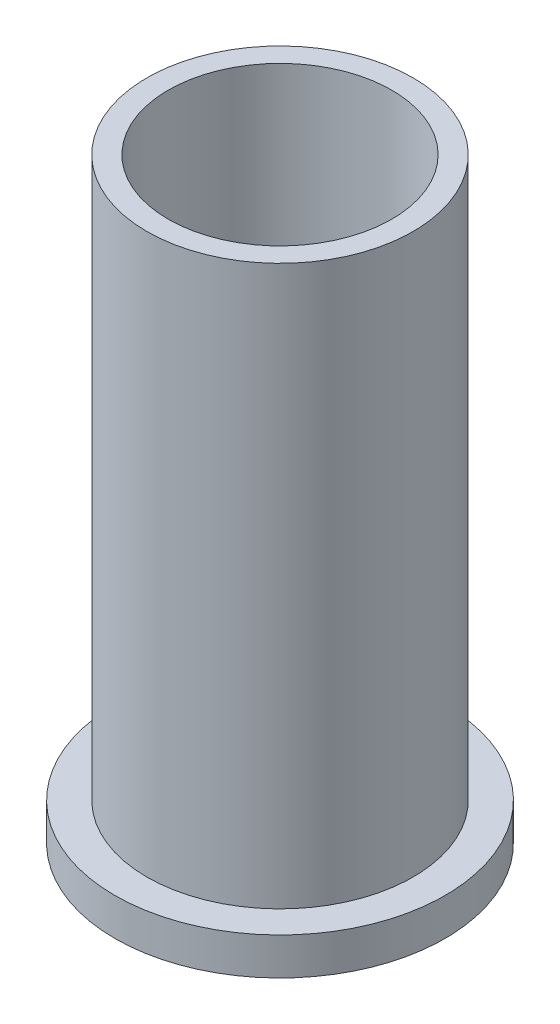
ISO-10303-21;
HEADER;
FILE_DESCRIPTION(('STEP AP214'),'2;1');
FILE_NAME('part.step','',(''),(''),'','','');
FILE_SCHEMA(('AUTOMOTIVE_DESIGN { 1 0 10303 214 1 1 1 1 }'));
ENDSEC;
DATA;
#1=APPLICATION_CONTEXT('core data for automotive mechanical design processes');
#2=APPLICATION_PROTOCOL_DEFINITION('international standard','automotive_design',2000,#1);
#3=PRODUCT_CONTEXT('',#1,'mechanical');
#4=PRODUCT('Part','Part','',(#3));
#5=PRODUCT_RELATED_PRODUCT_CATEGORY('part','',(#4));
#6=PRODUCT_DEFINITION_FORMATION('','',#4);
#7=PRODUCT_DEFINITION_CONTEXT('part definition',#1,'design');
#8=PRODUCT_DEFINITION('design','',#6,#7);
#9=PRODUCT_DEFINITION_SHAPE('','',#8);
#10=(LENGTH_UNIT() NAMED_UNIT(*) SI_UNIT(.MILLI.,.METRE.));
#11=(NAMED_UNIT(*) PLANE_ANGLE_UNIT() SI_UNIT($,.RADIAN.));
#12=(NAMED_UNIT(*) SI_UNIT($,.STERADIAN.) SOLID_ANGLE_UNIT());
#13=UNCERTAINTY_MEASURE_WITH_UNIT(LENGTH_MEASURE(1.E-05),#10,'distance_accuracy_value','');
#14=(GEOMETRIC_REPRESENTATION_CONTEXT(3) GLOBAL_UNCERTAINTY_ASSIGNED_CONTEXT((#13)) GLOBAL_UNIT_ASSIGNED_CONTEXT((#10,
#11,#12)) REPRESENTATION_CONTEXT('',''));
#15=CARTESIAN_POINT('',(0.,0.,0.));
#16=DIRECTION('',(0.,0.,1.));
#17=DIRECTION('',(1.,0.,0.));
#18=AXIS2_PLACEMENT_3D('',#15,#16,#17);
#19=CARTESIAN_POINT('',(0.,0.,0.));
#20=DIRECTION('',(0.,1.,0.));
#21=DIRECTION('',(0.,0.,1.));
#22=AXIS2_PLACEMENT_3D('',#19,#20,#21);
#23=CYLINDRICAL_SURFACE('',#22,21.);
#24=CARTESIAN_POINT('',(0.,-112.,0.));
#25=DIRECTION('',(0.,1.,0.));
#26=DIRECTION('',(0.,0.,1.));
#27=AXIS2_PLACEMENT_3D('',#24,#25,#26);
#28=CIRCLE('',#27,21.);
#29=CARTESIAN_POINT('',(0.,-112.,21.));
#30=VERTEX_POINT('',#29);
#31=EDGE_CURVE('E10',#30,#30,#28,.T.);
#32=ORIENTED_EDGE('',*,*,#31,.F.);
#33=EDGE_LOOP('',(#32));
#34=FACE_BOUND('',#33,.T.);
#35=CARTESIAN_POINT('',(0.,0.,0.));
#36=DIRECTION('',(0.,1.,0.));
#37=DIRECTION('',(0.,0.,1.));
#38=AXIS2_PLACEMENT_3D('',#35,#36,#37);
#39=CIRCLE('',#38,21.);
#40=CARTESIAN_POINT('',(0.,0.,21.));
#41=VERTEX_POINT('',#40);
#42=EDGE_CURVE('E53',#41,#41,#39,.T.);
#43=ORIENTED_EDGE('',*,*,#42,.T.);
#44=EDGE_LOOP('',(#43));
#45=FACE_BOUND('',#44,.T.);
#46=ADVANCED_FACE('F31',(#34,#45),#23,.F.);
#47=CARTESIAN_POINT('',(21.,-112.,0.));
#48=DIRECTION('',(0.,1.,0.));
#49=DIRECTION('',(0.,0.,1.));
#50=AXIS2_PLACEMENT_3D('',#47,#48,#49);
#51=PLANE('',#50);
#52=CARTESIAN_POINT('',(0.,-112.,0.));
#53=DIRECTION('',(0.,1.,0.));
#54=DIRECTION('',(0.,0.,1.));
#55=AXIS2_PLACEMENT_3D('',#52,#53,#54);
#56=CIRCLE('',#55,31.);
#57=CARTESIAN_POINT('',(0.,-112.,31.));
#58=VERTEX_POINT('',#57);
#59=EDGE_CURVE('E37',#58,#58,#56,.T.);
#60=ORIENTED_EDGE('',*,*,#59,.F.);
#61=EDGE_LOOP('',(#60));
#62=FACE_BOUND('',#61,.T.);
#63=ORIENTED_EDGE('',*,*,#31,.T.);
#64=EDGE_LOOP('',(#63));
#65=FACE_BOUND('',#64,.T.);
#66=ADVANCED_FACE('F78',(#62,#65),#51,.F.);
#67=CARTESIAN_POINT('',(0.,0.,0.));
#68=DIRECTION('',(0.,1.,0.));
#69=DIRECTION('',(0.,0.,1.));
#70=AXIS2_PLACEMENT_3D('',#67,#68,#69);
#71=CYLINDRICAL_SURFACE('',#70,31.);
#72=CARTESIAN_POINT('',(0.,-105.,0.));
#73=DIRECTION('',(0.,1.,0.));
#74=DIRECTION('',(0.,0.,1.));
#75=AXIS2_PLACEMENT_3D('',#72,#73,#74);
#76=CIRCLE('',#75,31.);
#77=CARTESIAN_POINT('',(0.,-105.,31.));
#78=VERTEX_POINT('',#77);
#79=EDGE_CURVE('E41',#78,#78,#76,.T.);
#80=ORIENTED_EDGE('',*,*,#79,.F.);
#81=EDGE_LOOP('',(#80));
#82=FACE_BOUND('',#81,.T.);
#83=ORIENTED_EDGE('',*,*,#59,.T.);
#84=EDGE_LOOP('',(#83));
#85=FACE_BOUND('',#84,.T.);
#86=ADVANCED_FACE('F73',(#82,#85),#71,.T.);
#87=CARTESIAN_POINT('',(25.,-105.,0.));
#88=DIRECTION('',(0.,-1.,0.));
#89=DIRECTION('',(0.,0.,-1.));
#90=AXIS2_PLACEMENT_3D('',#87,#88,#89);
#91=PLANE('',#90);
#92=CARTESIAN_POINT('',(0.,-105.,0.));
#93=DIRECTION('',(0.,1.,0.));
#94=DIRECTION('',(0.,0.,1.));
#95=AXIS2_PLACEMENT_3D('',#92,#93,#94);
#96=CIRCLE('',#95,25.);
#97=CARTESIAN_POINT('',(0.,-105.,25.));
#98=VERTEX_POINT('',#97);
#99=EDGE_CURVE('E45',#98,#98,#96,.T.);
#100=ORIENTED_EDGE('',*,*,#99,.F.);
#101=EDGE_LOOP('',(#100));
#102=FACE_BOUND('',#101,.T.);
#103=ORIENTED_EDGE('',*,*,#79,.T.);
#104=EDGE_LOOP('',(#103));
#105=FACE_BOUND('',#104,.T.);
#106=ADVANCED_FACE('F67',(#102,#105),#91,.F.);
#107=CARTESIAN_POINT('',(0.,0.,0.));
#108=DIRECTION('',(0.,1.,0.));
#109=DIRECTION('',(0.,0.,1.));
#110=AXIS2_PLACEMENT_3D('',#107,#108,#109);
#111=CYLINDRICAL_SURFACE('',#110,25.);
#112=CARTESIAN_POINT('',(0.,0.,0.));
#113=DIRECTION('',(0.,1.,0.));
#114=DIRECTION('',(0.,0.,1.));
#115=AXIS2_PLACEMENT_3D('',#112,#113,#114);
#116=CIRCLE('',#115,25.);
#117=CARTESIAN_POINT('',(0.,0.,25.));
#118=VERTEX_POINT('',#117);
#119=EDGE_CURVE('E50',#118,#118,#116,.T.);
#120=ORIENTED_EDGE('',*,*,#119,.F.);
#121=EDGE_LOOP('',(#120));
#122=FACE_BOUND('',#121,.T.);
#123=ORIENTED_EDGE('',*,*,#99,.T.);
#124=EDGE_LOOP('',(#123));
#125=FACE_BOUND('',#124,.T.);
#126=ADVANCED_FACE('F61',(#122,#125),#111,.T.);
#127=CARTESIAN_POINT('',(21.,0.,0.));
#128=DIRECTION('',(0.,-1.,0.));
#129=DIRECTION('',(0.,0.,-1.));
#130=AXIS2_PLACEMENT_3D('',#127,#128,#129);
#131=PLANE('',#130);
#132=ORIENTED_EDGE('',*,*,#42,.F.);
#133=EDGE_LOOP('',(#132));
#134=FACE_BOUND('',#133,.T.);
#135=ORIENTED_EDGE('',*,*,#119,.T.);
#136=EDGE_LOOP('',(#135));
#137=FACE_BOUND('',#136,.T.);
#138=ADVANCED_FACE('F58',(#134,#137),#131,.F.);
#139=CLOSED_SHELL('',(#46,#66,#86,#106,#126,#138));
#140=MANIFOLD_SOLID_BREP('B2',#139);
#141=ADVANCED_BREP_SHAPE_REPRESENTATION('',(#18,#140),#14);
#142=SHAPE_DEFINITION_REPRESENTATION(#9,#141);
ENDSEC;
END-ISO-10303-21;
